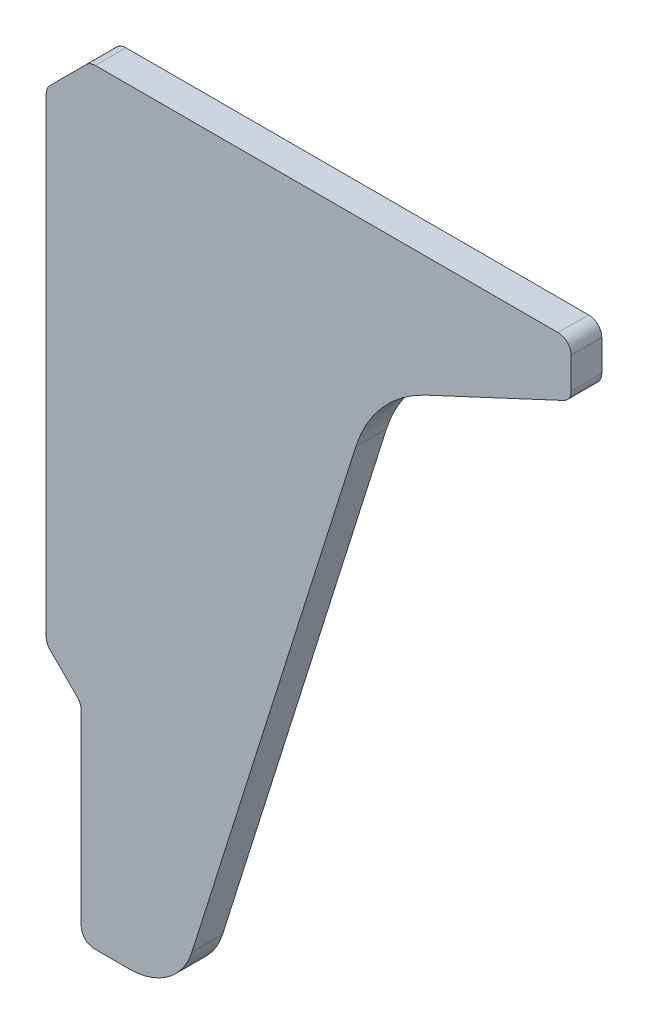
ISO-10303-21;
HEADER;
FILE_DESCRIPTION(('STEP AP214'),'2;1');
FILE_NAME('part.step','',(''),(''),'','','');
FILE_SCHEMA(('AUTOMOTIVE_DESIGN { 1 0 10303 214 1 1 1 1 }'));
ENDSEC;
DATA;
#1=APPLICATION_CONTEXT('core data for automotive mechanical design processes');
#2=APPLICATION_PROTOCOL_DEFINITION('international standard','automotive_design',2000,#1);
#3=PRODUCT_CONTEXT('',#1,'mechanical');
#4=PRODUCT('Part','Part','',(#3));
#5=PRODUCT_RELATED_PRODUCT_CATEGORY('part','',(#4));
#6=PRODUCT_DEFINITION_FORMATION('','',#4);
#7=PRODUCT_DEFINITION_CONTEXT('part definition',#1,'design');
#8=PRODUCT_DEFINITION('design','',#6,#7);
#9=PRODUCT_DEFINITION_SHAPE('','',#8);
#10=(LENGTH_UNIT() NAMED_UNIT(*) SI_UNIT(.MILLI.,.METRE.));
#11=(NAMED_UNIT(*) PLANE_ANGLE_UNIT() SI_UNIT($,.RADIAN.));
#12=(NAMED_UNIT(*) SI_UNIT($,.STERADIAN.) SOLID_ANGLE_UNIT());
#13=UNCERTAINTY_MEASURE_WITH_UNIT(LENGTH_MEASURE(1.E-05),#10,'distance_accuracy_value','');
#14=(GEOMETRIC_REPRESENTATION_CONTEXT(3) GLOBAL_UNCERTAINTY_ASSIGNED_CONTEXT((#13)) GLOBAL_UNIT_ASSIGNED_CONTEXT((#10,
#11,#12)) REPRESENTATION_CONTEXT('',''));
#15=CARTESIAN_POINT('',(0.,0.,0.));
#16=DIRECTION('',(0.,0.,1.));
#17=DIRECTION('',(1.,0.,0.));
#18=AXIS2_PLACEMENT_3D('',#15,#16,#17);
#19=CARTESIAN_POINT('',(91.3812704140145,120.283990923753,7.));
#20=DIRECTION('',(0.,0.,-1.));
#21=DIRECTION('',(-1.,0.,0.));
#22=AXIS2_PLACEMENT_3D('',#19,#20,#21);
#23=CYLINDRICAL_SURFACE('',#22,30.);
#24=CARTESIAN_POINT('',(91.3812704140145,120.283990923753,0.));
#25=DIRECTION('',(0.,0.,-1.));
#26=DIRECTION('',(1.,0.,0.));
#27=AXIS2_PLACEMENT_3D('',#24,#25,#26);
#28=CIRCLE('',#27,30.);
#29=CARTESIAN_POINT('',(62.7697618915677,129.305164908882,0.));
#30=VERTEX_POINT('',#29);
#31=CARTESIAN_POINT('',(78.7027225617937,147.473224534853,0.));
#32=VERTEX_POINT('',#31);
#33=EDGE_CURVE('E195',#30,#32,#28,.T.);
#34=ORIENTED_EDGE('',*,*,#33,.T.);
#35=DIRECTION('',(0.,0.,-1.));
#36=VECTOR('',#35,1.);
#37=CARTESIAN_POINT('',(78.7027225617937,147.473224534853,7.));
#38=LINE('',#37,#36);
#39=CARTESIAN_POINT('',(78.7027225617937,147.473224534853,7.));
#40=VERTEX_POINT('',#39);
#41=EDGE_CURVE('E11',#40,#32,#38,.T.);
#42=ORIENTED_EDGE('',*,*,#41,.F.);
#43=CARTESIAN_POINT('',(91.3812704140145,120.283990923753,7.));
#44=DIRECTION('',(0.,0.,-1.));
#45=DIRECTION('',(1.,0.,0.));
#46=AXIS2_PLACEMENT_3D('',#43,#44,#45);
#47=CIRCLE('',#46,30.);
#48=CARTESIAN_POINT('',(62.7697618915677,129.305164908882,7.));
#49=VERTEX_POINT('',#48);
#50=EDGE_CURVE('E229',#49,#40,#47,.T.);
#51=ORIENTED_EDGE('',*,*,#50,.F.);
#52=DIRECTION('',(0.,0.,-1.));
#53=VECTOR('',#52,1.);
#54=CARTESIAN_POINT('',(62.7697618915677,129.305164908882,7.));
#55=LINE('',#54,#53);
#56=EDGE_CURVE('E191',#49,#30,#55,.T.);
#57=ORIENTED_EDGE('',*,*,#56,.T.);
#58=EDGE_LOOP('',(#34,#42,#51,#57));
#59=FACE_BOUND('',#58,.T.);
#60=ADVANCED_FACE('F39',(#59),#23,.F.);
#61=CARTESIAN_POINT('',(110.267854785222,162.192287421312,7.));
#62=DIRECTION('',(-0.422618261740693,0.906307787036653,0.));
#63=DIRECTION('',(-0.906307787036653,-0.422618261740693,0.));
#64=AXIS2_PLACEMENT_3D('',#61,#62,#63);
#65=PLANE('',#64);
#66=DIRECTION('',(0.906307787036653,0.422618261740693,0.));
#67=VECTOR('',#66,1.);
#68=CARTESIAN_POINT('',(110.267854785222,162.192287421312,0.));
#69=LINE('',#68,#67);
#70=CARTESIAN_POINT('',(110.267854785222,162.192287421312,0.));
#71=VERTEX_POINT('',#70);
#72=EDGE_CURVE('E198',#32,#71,#69,.T.);
#73=ORIENTED_EDGE('',*,*,#72,.T.);
#74=DIRECTION('',(0.,0.,-1.));
#75=VECTOR('',#74,1.);
#76=CARTESIAN_POINT('',(110.267854785222,162.192287421312,7.));
#77=LINE('',#76,#75);
#78=CARTESIAN_POINT('',(110.267854785222,162.192287421312,7.));
#79=VERTEX_POINT('',#78);
#80=EDGE_CURVE('E47',#79,#71,#77,.T.);
#81=ORIENTED_EDGE('',*,*,#80,.F.);
#82=DIRECTION('',(0.906307787036653,0.422618261740693,0.));
#83=VECTOR('',#82,1.);
#84=CARTESIAN_POINT('',(110.267854785222,162.192287421312,7.));
#85=LINE('',#84,#83);
#86=EDGE_CURVE('E128',#40,#79,#85,.T.);
#87=ORIENTED_EDGE('',*,*,#86,.F.);
#88=ORIENTED_EDGE('',*,*,#41,.T.);
#89=EDGE_LOOP('',(#73,#81,#87,#88));
#90=FACE_BOUND('',#89,.T.);
#91=ADVANCED_FACE('F337',(#90),#65,.F.);
#92=CARTESIAN_POINT('',(109.,164.911210782422,7.));
#93=DIRECTION('',(0.,0.,-1.));
#94=DIRECTION('',(-1.,0.,0.));
#95=AXIS2_PLACEMENT_3D('',#92,#93,#94);
#96=CYLINDRICAL_SURFACE('',#95,3.);
#97=CARTESIAN_POINT('',(109.,164.911210782422,0.));
#98=DIRECTION('',(0.,0.,1.));
#99=DIRECTION('',(1.,0.,0.));
#100=AXIS2_PLACEMENT_3D('',#97,#98,#99);
#101=CIRCLE('',#100,3.);
#102=CARTESIAN_POINT('',(112.,164.911210782422,0.));
#103=VERTEX_POINT('',#102);
#104=EDGE_CURVE('E200',#71,#103,#101,.T.);
#105=ORIENTED_EDGE('',*,*,#104,.T.);
#106=DIRECTION('',(0.,0.,-1.));
#107=VECTOR('',#106,1.);
#108=CARTESIAN_POINT('',(112.,164.911210782422,7.));
#109=LINE('',#108,#107);
#110=CARTESIAN_POINT('',(112.,164.911210782422,7.));
#111=VERTEX_POINT('',#110);
#112=EDGE_CURVE('E266',#111,#103,#109,.T.);
#113=ORIENTED_EDGE('',*,*,#112,.F.);
#114=CARTESIAN_POINT('',(109.,164.911210782422,7.));
#115=DIRECTION('',(0.,0.,1.));
#116=DIRECTION('',(1.,0.,0.));
#117=AXIS2_PLACEMENT_3D('',#114,#115,#116);
#118=CIRCLE('',#117,3.);
#119=EDGE_CURVE('E274',#79,#111,#118,.T.);
#120=ORIENTED_EDGE('',*,*,#119,.F.);
#121=ORIENTED_EDGE('',*,*,#80,.T.);
#122=EDGE_LOOP('',(#105,#113,#120,#121));
#123=FACE_BOUND('',#122,.T.);
#124=ADVANCED_FACE('F272',(#123),#96,.T.);
#125=CARTESIAN_POINT('',(112.,172.,7.));
#126=DIRECTION('',(-1.,0.,0.));
#127=DIRECTION('',(0.,0.,1.));
#128=AXIS2_PLACEMENT_3D('',#125,#126,#127);
#129=PLANE('',#128);
#130=DIRECTION('',(0.,1.,0.));
#131=VECTOR('',#130,1.);
#132=CARTESIAN_POINT('',(112.,172.,0.));
#133=LINE('',#132,#131);
#134=CARTESIAN_POINT('',(112.,172.,0.));
#135=VERTEX_POINT('',#134);
#136=EDGE_CURVE('E202',#103,#135,#133,.T.);
#137=ORIENTED_EDGE('',*,*,#136,.T.);
#138=DIRECTION('',(0.,0.,-1.));
#139=VECTOR('',#138,1.);
#140=CARTESIAN_POINT('',(112.,172.,7.));
#141=LINE('',#140,#139);
#142=CARTESIAN_POINT('',(112.,172.,7.));
#143=VERTEX_POINT('',#142);
#144=EDGE_CURVE('E263',#143,#135,#141,.T.);
#145=ORIENTED_EDGE('',*,*,#144,.F.);
#146=DIRECTION('',(0.,1.,0.));
#147=VECTOR('',#146,1.);
#148=CARTESIAN_POINT('',(112.,172.,7.));
#149=LINE('',#148,#147);
#150=EDGE_CURVE('E292',#111,#143,#149,.T.);
#151=ORIENTED_EDGE('',*,*,#150,.F.);
#152=ORIENTED_EDGE('',*,*,#112,.T.);
#153=EDGE_LOOP('',(#137,#145,#151,#152));
#154=FACE_BOUND('',#153,.T.);
#155=ADVANCED_FACE('F283',(#154),#129,.F.);
#156=CARTESIAN_POINT('',(109.,172.,7.));
#157=DIRECTION('',(0.,0.,-1.));
#158=DIRECTION('',(-1.,0.,0.));
#159=AXIS2_PLACEMENT_3D('',#156,#157,#158);
#160=CYLINDRICAL_SURFACE('',#159,3.);
#161=CARTESIAN_POINT('',(109.,172.,0.));
#162=DIRECTION('',(0.,0.,1.));
#163=DIRECTION('',(-1.,0.,0.));
#164=AXIS2_PLACEMENT_3D('',#161,#162,#163);
#165=CIRCLE('',#164,3.);
#166=CARTESIAN_POINT('',(109.,175.,0.));
#167=VERTEX_POINT('',#166);
#168=EDGE_CURVE('E204',#135,#167,#165,.T.);
#169=ORIENTED_EDGE('',*,*,#168,.T.);
#170=DIRECTION('',(0.,0.,-1.));
#171=VECTOR('',#170,1.);
#172=CARTESIAN_POINT('',(109.,175.,7.));
#173=LINE('',#172,#171);
#174=CARTESIAN_POINT('',(109.,175.,7.));
#175=VERTEX_POINT('',#174);
#176=EDGE_CURVE('E260',#175,#167,#173,.T.);
#177=ORIENTED_EDGE('',*,*,#176,.F.);
#178=CARTESIAN_POINT('',(109.,172.,7.));
#179=DIRECTION('',(0.,0.,1.));
#180=DIRECTION('',(-1.,0.,0.));
#181=AXIS2_PLACEMENT_3D('',#178,#179,#180);
#182=CIRCLE('',#181,3.);
#183=EDGE_CURVE('E289',#143,#175,#182,.T.);
#184=ORIENTED_EDGE('',*,*,#183,.F.);
#185=ORIENTED_EDGE('',*,*,#144,.T.);
#186=EDGE_LOOP('',(#169,#177,#184,#185));
#187=FACE_BOUND('',#186,.T.);
#188=ADVANCED_FACE('F287',(#187),#160,.T.);
#189=CARTESIAN_POINT('',(3.24264068711928,175.,7.));
#190=DIRECTION('',(0.,-1.,0.));
#191=DIRECTION('',(0.,0.,-1.));
#192=AXIS2_PLACEMENT_3D('',#189,#190,#191);
#193=PLANE('',#192);
#194=DIRECTION('',(-1.,0.,0.));
#195=VECTOR('',#194,1.);
#196=CARTESIAN_POINT('',(3.24264068711928,175.,0.));
#197=LINE('',#196,#195);
#198=CARTESIAN_POINT('',(3.24264068711928,175.,0.));
#199=VERTEX_POINT('',#198);
#200=EDGE_CURVE('E206',#167,#199,#197,.T.);
#201=ORIENTED_EDGE('',*,*,#200,.T.);
#202=DIRECTION('',(0.,0.,-1.));
#203=VECTOR('',#202,1.);
#204=CARTESIAN_POINT('',(3.24264068711928,175.,7.));
#205=LINE('',#204,#203);
#206=CARTESIAN_POINT('',(3.24264068711928,175.,7.));
#207=VERTEX_POINT('',#206);
#208=EDGE_CURVE('E257',#207,#199,#205,.T.);
#209=ORIENTED_EDGE('',*,*,#208,.F.);
#210=DIRECTION('',(-1.,0.,0.));
#211=VECTOR('',#210,1.);
#212=CARTESIAN_POINT('',(3.24264068711928,175.,7.));
#213=LINE('',#212,#211);
#214=EDGE_CURVE('E291',#175,#207,#213,.T.);
#215=ORIENTED_EDGE('',*,*,#214,.F.);
#216=ORIENTED_EDGE('',*,*,#176,.T.);
#217=EDGE_LOOP('',(#201,#209,#215,#216));
#218=FACE_BOUND('',#217,.T.);
#219=ADVANCED_FACE('F350',(#218),#193,.F.);
#220=CARTESIAN_POINT('',(3.24264068711928,172.,7.));
#221=DIRECTION('',(0.,0.,-1.));
#222=DIRECTION('',(-1.,0.,0.));
#223=AXIS2_PLACEMENT_3D('',#220,#221,#222);
#224=CYLINDRICAL_SURFACE('',#223,3.);
#225=CARTESIAN_POINT('',(3.24264068711928,172.,0.));
#226=DIRECTION('',(0.,0.,1.));
#227=DIRECTION('',(-1.,0.,0.));
#228=AXIS2_PLACEMENT_3D('',#225,#226,#227);
#229=CIRCLE('',#228,3.);
#230=CARTESIAN_POINT('',(1.12132034355963,174.12132034356,0.));
#231=VERTEX_POINT('',#230);
#232=EDGE_CURVE('E208',#199,#231,#229,.T.);
#233=ORIENTED_EDGE('',*,*,#232,.T.);
#234=DIRECTION('',(0.,0.,-1.));
#235=VECTOR('',#234,1.);
#236=CARTESIAN_POINT('',(1.12132034355963,174.12132034356,7.));
#237=LINE('',#236,#235);
#238=CARTESIAN_POINT('',(1.12132034355963,174.12132034356,7.));
#239=VERTEX_POINT('',#238);
#240=EDGE_CURVE('E254',#239,#231,#237,.T.);
#241=ORIENTED_EDGE('',*,*,#240,.F.);
#242=CARTESIAN_POINT('',(3.24264068711928,172.,7.));
#243=DIRECTION('',(0.,0.,1.));
#244=DIRECTION('',(-1.,0.,0.));
#245=AXIS2_PLACEMENT_3D('',#242,#243,#244);
#246=CIRCLE('',#245,3.);
#247=EDGE_CURVE('E294',#207,#239,#246,.T.);
#248=ORIENTED_EDGE('',*,*,#247,.F.);
#249=ORIENTED_EDGE('',*,*,#208,.T.);
#250=EDGE_LOOP('',(#233,#241,#248,#249));
#251=FACE_BOUND('',#250,.T.);
#252=ADVANCED_FACE('F353',(#251),#224,.T.);
#253=CARTESIAN_POINT('',(-7.12132034355964,165.87867965644,7.));
#254=DIRECTION('',(0.707106781186547,-0.707106781186548,0.));
#255=DIRECTION('',(0.707106781186548,0.707106781186547,0.));
#256=AXIS2_PLACEMENT_3D('',#253,#254,#255);
#257=PLANE('',#256);
#258=DIRECTION('',(-0.707106781186548,-0.707106781186547,0.));
#259=VECTOR('',#258,1.);
#260=CARTESIAN_POINT('',(-7.12132034355964,165.87867965644,0.));
#261=LINE('',#260,#259);
#262=CARTESIAN_POINT('',(-7.12132034355964,165.87867965644,0.));
#263=VERTEX_POINT('',#262);
#264=EDGE_CURVE('E210',#231,#263,#261,.T.);
#265=ORIENTED_EDGE('',*,*,#264,.T.);
#266=DIRECTION('',(0.,0.,-1.));
#267=VECTOR('',#266,1.);
#268=CARTESIAN_POINT('',(-7.12132034355964,165.87867965644,7.));
#269=LINE('',#268,#267);
#270=CARTESIAN_POINT('',(-7.12132034355964,165.87867965644,7.));
#271=VERTEX_POINT('',#270);
#272=EDGE_CURVE('E251',#271,#263,#269,.T.);
#273=ORIENTED_EDGE('',*,*,#272,.F.);
#274=DIRECTION('',(-0.707106781186548,-0.707106781186547,0.));
#275=VECTOR('',#274,1.);
#276=CARTESIAN_POINT('',(-7.12132034355964,165.87867965644,7.));
#277=LINE('',#276,#275);
#278=EDGE_CURVE('E300',#239,#271,#277,.T.);
#279=ORIENTED_EDGE('',*,*,#278,.F.);
#280=ORIENTED_EDGE('',*,*,#240,.T.);
#281=EDGE_LOOP('',(#265,#273,#279,#280));
#282=FACE_BOUND('',#281,.T.);
#283=ADVANCED_FACE('F357',(#282),#257,.F.);
#284=CARTESIAN_POINT('',(-5.,163.757359312881,7.));
#285=DIRECTION('',(0.,0.,-1.));
#286=DIRECTION('',(-1.,0.,0.));
#287=AXIS2_PLACEMENT_3D('',#284,#285,#286);
#288=CYLINDRICAL_SURFACE('',#287,3.);
#289=CARTESIAN_POINT('',(-5.,163.757359312881,0.));
#290=DIRECTION('',(0.,0.,1.));
#291=DIRECTION('',(1.,0.,0.));
#292=AXIS2_PLACEMENT_3D('',#289,#290,#291);
#293=CIRCLE('',#292,3.);
#294=CARTESIAN_POINT('',(-8.,163.757359312881,0.));
#295=VERTEX_POINT('',#294);
#296=EDGE_CURVE('E212',#263,#295,#293,.T.);
#297=ORIENTED_EDGE('',*,*,#296,.T.);
#298=DIRECTION('',(0.,0.,-1.));
#299=VECTOR('',#298,1.);
#300=CARTESIAN_POINT('',(-8.,163.757359312881,7.));
#301=LINE('',#300,#299);
#302=CARTESIAN_POINT('',(-8.,163.757359312881,7.));
#303=VERTEX_POINT('',#302);
#304=EDGE_CURVE('E248',#303,#295,#301,.T.);
#305=ORIENTED_EDGE('',*,*,#304,.F.);
#306=CARTESIAN_POINT('',(-5.,163.757359312881,7.));
#307=DIRECTION('',(0.,0.,1.));
#308=DIRECTION('',(1.,0.,0.));
#309=AXIS2_PLACEMENT_3D('',#306,#307,#308);
#310=CIRCLE('',#309,3.);
#311=EDGE_CURVE('E302',#271,#303,#310,.T.);
#312=ORIENTED_EDGE('',*,*,#311,.F.);
#313=ORIENTED_EDGE('',*,*,#272,.T.);
#314=EDGE_LOOP('',(#297,#305,#312,#313));
#315=FACE_BOUND('',#314,.T.);
#316=ADVANCED_FACE('F361',(#315),#288,.T.);
#317=CARTESIAN_POINT('',(-8.,56.2426406871193,7.));
#318=DIRECTION('',(1.,0.,0.));
#319=DIRECTION('',(0.,1.,0.));
#320=AXIS2_PLACEMENT_3D('',#317,#318,#319);
#321=PLANE('',#320);
#322=DIRECTION('',(0.,-1.,0.));
#323=VECTOR('',#322,1.);
#324=CARTESIAN_POINT('',(-8.,56.2426406871193,0.));
#325=LINE('',#324,#323);
#326=CARTESIAN_POINT('',(-8.,56.2426406871193,0.));
#327=VERTEX_POINT('',#326);
#328=EDGE_CURVE('E214',#295,#327,#325,.T.);
#329=ORIENTED_EDGE('',*,*,#328,.T.);
#330=DIRECTION('',(0.,0.,-1.));
#331=VECTOR('',#330,1.);
#332=CARTESIAN_POINT('',(-8.,56.2426406871193,7.));
#333=LINE('',#332,#331);
#334=CARTESIAN_POINT('',(-8.,56.2426406871193,7.));
#335=VERTEX_POINT('',#334);
#336=EDGE_CURVE('E245',#335,#327,#333,.T.);
#337=ORIENTED_EDGE('',*,*,#336,.F.);
#338=DIRECTION('',(0.,-1.,0.));
#339=VECTOR('',#338,1.);
#340=CARTESIAN_POINT('',(-8.,56.2426406871193,7.));
#341=LINE('',#340,#339);
#342=EDGE_CURVE('E304',#303,#335,#341,.T.);
#343=ORIENTED_EDGE('',*,*,#342,.F.);
#344=ORIENTED_EDGE('',*,*,#304,.T.);
#345=EDGE_LOOP('',(#329,#337,#343,#344));
#346=FACE_BOUND('',#345,.T.);
#347=ADVANCED_FACE('F365',(#346),#321,.F.);
#348=CARTESIAN_POINT('',(-5.,56.2426406871193,7.));
#349=DIRECTION('',(0.,0.,-1.));
#350=DIRECTION('',(-1.,0.,0.));
#351=AXIS2_PLACEMENT_3D('',#348,#349,#350);
#352=CYLINDRICAL_SURFACE('',#351,3.);
#353=CARTESIAN_POINT('',(-5.,56.2426406871193,0.));
#354=DIRECTION('',(0.,0.,1.));
#355=DIRECTION('',(-1.,0.,0.));
#356=AXIS2_PLACEMENT_3D('',#353,#354,#355);
#357=CIRCLE('',#356,3.);
#358=CARTESIAN_POINT('',(-7.12132034355964,54.1213203435597,0.));
#359=VERTEX_POINT('',#358);
#360=EDGE_CURVE('E216',#327,#359,#357,.T.);
#361=ORIENTED_EDGE('',*,*,#360,.T.);
#362=DIRECTION('',(0.,0.,-1.));
#363=VECTOR('',#362,1.);
#364=CARTESIAN_POINT('',(-7.12132034355964,54.1213203435597,7.));
#365=LINE('',#364,#363);
#366=CARTESIAN_POINT('',(-7.12132034355964,54.1213203435597,7.));
#367=VERTEX_POINT('',#366);
#368=EDGE_CURVE('E242',#367,#359,#365,.T.);
#369=ORIENTED_EDGE('',*,*,#368,.F.);
#370=CARTESIAN_POINT('',(-5.,56.2426406871193,7.));
#371=DIRECTION('',(0.,0.,1.));
#372=DIRECTION('',(-1.,0.,0.));
#373=AXIS2_PLACEMENT_3D('',#370,#371,#372);
#374=CIRCLE('',#373,3.);
#375=EDGE_CURVE('E306',#335,#367,#374,.T.);
#376=ORIENTED_EDGE('',*,*,#375,.F.);
#377=ORIENTED_EDGE('',*,*,#336,.T.);
#378=EDGE_LOOP('',(#361,#369,#376,#377));
#379=FACE_BOUND('',#378,.T.);
#380=ADVANCED_FACE('F369',(#379),#352,.T.);
#381=CARTESIAN_POINT('',(-7.12132034355964,54.1213203435597,7.));
#382=DIRECTION('',(0.707106781186547,0.707106781186547,0.));
#383=DIRECTION('',(-0.707106781186548,0.707106781186548,0.));
#384=AXIS2_PLACEMENT_3D('',#381,#382,#383);
#385=PLANE('',#384);
#386=DIRECTION('',(0.707106781186548,-0.707106781186548,0.));
#387=VECTOR('',#386,1.);
#388=CARTESIAN_POINT('',(-7.12132034355964,54.1213203435597,0.));
#389=LINE('',#388,#387);
#390=CARTESIAN_POINT('',(-0.878679656440354,47.8786796564404,0.));
#391=VERTEX_POINT('',#390);
#392=EDGE_CURVE('E218',#359,#391,#389,.T.);
#393=ORIENTED_EDGE('',*,*,#392,.T.);
#394=DIRECTION('',(0.,0.,-1.));
#395=VECTOR('',#394,1.);
#396=CARTESIAN_POINT('',(-0.878679656440354,47.8786796564404,7.));
#397=LINE('',#396,#395);
#398=CARTESIAN_POINT('',(-0.878679656440354,47.8786796564404,7.));
#399=VERTEX_POINT('',#398);
#400=EDGE_CURVE('E239',#399,#391,#397,.T.);
#401=ORIENTED_EDGE('',*,*,#400,.F.);
#402=DIRECTION('',(0.707106781186548,-0.707106781186548,0.));
#403=VECTOR('',#402,1.);
#404=CARTESIAN_POINT('',(-7.12132034355964,54.1213203435597,7.));
#405=LINE('',#404,#403);
#406=EDGE_CURVE('E308',#367,#399,#405,.T.);
#407=ORIENTED_EDGE('',*,*,#406,.F.);
#408=ORIENTED_EDGE('',*,*,#368,.T.);
#409=EDGE_LOOP('',(#393,#401,#407,#408));
#410=FACE_BOUND('',#409,.T.);
#411=ADVANCED_FACE('F373',(#410),#385,.F.);
#412=CARTESIAN_POINT('',(-3.,45.7573593128807,7.));
#413=DIRECTION('',(0.,0.,-1.));
#414=DIRECTION('',(-1.,0.,0.));
#415=AXIS2_PLACEMENT_3D('',#412,#413,#414);
#416=CYLINDRICAL_SURFACE('',#415,3.);
#417=CARTESIAN_POINT('',(-3.,45.7573593128807,0.));
#418=DIRECTION('',(0.,0.,-1.));
#419=DIRECTION('',(-1.,0.,0.));
#420=AXIS2_PLACEMENT_3D('',#417,#418,#419);
#421=CIRCLE('',#420,3.);
#422=CARTESIAN_POINT('',(0.,45.7573593128807,0.));
#423=VERTEX_POINT('',#422);
#424=EDGE_CURVE('E220',#391,#423,#421,.T.);
#425=ORIENTED_EDGE('',*,*,#424,.T.);
#426=DIRECTION('',(0.,0.,-1.));
#427=VECTOR('',#426,1.);
#428=CARTESIAN_POINT('',(0.,45.7573593128807,7.));
#429=LINE('',#428,#427);
#430=CARTESIAN_POINT('',(0.,45.7573593128807,7.));
#431=VERTEX_POINT('',#430);
#432=EDGE_CURVE('E236',#431,#423,#429,.T.);
#433=ORIENTED_EDGE('',*,*,#432,.F.);
#434=CARTESIAN_POINT('',(-3.,45.7573593128807,7.));
#435=DIRECTION('',(0.,0.,-1.));
#436=DIRECTION('',(-1.,0.,0.));
#437=AXIS2_PLACEMENT_3D('',#434,#435,#436);
#438=CIRCLE('',#437,3.);
#439=EDGE_CURVE('E310',#399,#431,#438,.T.);
#440=ORIENTED_EDGE('',*,*,#439,.F.);
#441=ORIENTED_EDGE('',*,*,#400,.T.);
#442=EDGE_LOOP('',(#425,#433,#440,#441));
#443=FACE_BOUND('',#442,.T.);
#444=ADVANCED_FACE('F377',(#443),#416,.F.);
#445=CARTESIAN_POINT('',(0.,3.00000000000002,7.));
#446=DIRECTION('',(1.,0.,0.));
#447=DIRECTION('',(0.,1.,0.));
#448=AXIS2_PLACEMENT_3D('',#445,#446,#447);
#449=PLANE('',#448);
#450=DIRECTION('',(0.,-1.,0.));
#451=VECTOR('',#450,1.);
#452=CARTESIAN_POINT('',(0.,3.00000000000002,0.));
#453=LINE('',#452,#451);
#454=CARTESIAN_POINT('',(0.,3.00000000000002,0.));
#455=VERTEX_POINT('',#454);
#456=EDGE_CURVE('E222',#423,#455,#453,.T.);
#457=ORIENTED_EDGE('',*,*,#456,.T.);
#458=DIRECTION('',(0.,0.,-1.));
#459=VECTOR('',#458,1.);
#460=CARTESIAN_POINT('',(0.,3.00000000000002,7.));
#461=LINE('',#460,#459);
#462=CARTESIAN_POINT('',(0.,3.00000000000002,7.));
#463=VERTEX_POINT('',#462);
#464=EDGE_CURVE('E233',#463,#455,#461,.T.);
#465=ORIENTED_EDGE('',*,*,#464,.F.);
#466=DIRECTION('',(0.,-1.,0.));
#467=VECTOR('',#466,1.);
#468=CARTESIAN_POINT('',(0.,3.00000000000002,7.));
#469=LINE('',#468,#467);
#470=EDGE_CURVE('E312',#431,#463,#469,.T.);
#471=ORIENTED_EDGE('',*,*,#470,.F.);
#472=ORIENTED_EDGE('',*,*,#432,.T.);
#473=EDGE_LOOP('',(#457,#465,#471,#472));
#474=FACE_BOUND('',#473,.T.);
#475=ADVANCED_FACE('F318',(#474),#449,.F.);
#476=CARTESIAN_POINT('',(3.,3.,7.));
#477=DIRECTION('',(0.,0.,-1.));
#478=DIRECTION('',(-1.,0.,0.));
#479=AXIS2_PLACEMENT_3D('',#476,#477,#478);
#480=CYLINDRICAL_SURFACE('',#479,3.);
#481=CARTESIAN_POINT('',(3.,3.,0.));
#482=DIRECTION('',(0.,0.,1.));
#483=DIRECTION('',(1.,0.,0.));
#484=AXIS2_PLACEMENT_3D('',#481,#482,#483);
#485=CIRCLE('',#484,3.);
#486=CARTESIAN_POINT('',(3.00000000000002,0.,0.));
#487=VERTEX_POINT('',#486);
#488=EDGE_CURVE('E224',#455,#487,#485,.T.);
#489=ORIENTED_EDGE('',*,*,#488,.T.);
#490=DIRECTION('',(0.,0.,-1.));
#491=VECTOR('',#490,1.);
#492=CARTESIAN_POINT('',(3.00000000000002,0.,7.));
#493=LINE('',#492,#491);
#494=CARTESIAN_POINT('',(3.00000000000002,0.,7.));
#495=VERTEX_POINT('',#494);
#496=EDGE_CURVE('E186',#495,#487,#493,.T.);
#497=ORIENTED_EDGE('',*,*,#496,.F.);
#498=CARTESIAN_POINT('',(3.,3.,7.));
#499=DIRECTION('',(0.,0.,1.));
#500=DIRECTION('',(1.,0.,0.));
#501=AXIS2_PLACEMENT_3D('',#498,#499,#500);
#502=CIRCLE('',#501,3.);
#503=EDGE_CURVE('E177',#463,#495,#502,.T.);
#504=ORIENTED_EDGE('',*,*,#503,.F.);
#505=ORIENTED_EDGE('',*,*,#464,.T.);
#506=EDGE_LOOP('',(#489,#497,#504,#505));
#507=FACE_BOUND('',#506,.T.);
#508=ADVANCED_FACE('F322',(#507),#480,.T.);
#509=CARTESIAN_POINT('',(11.0015449560726,0.,7.));
#510=DIRECTION('',(0.,1.,0.));
#511=DIRECTION('',(0.,0.,1.));
#512=AXIS2_PLACEMENT_3D('',#509,#510,#511);
#513=PLANE('',#512);
#514=DIRECTION('',(1.,0.,0.));
#515=VECTOR('',#514,1.);
#516=CARTESIAN_POINT('',(11.0015449560726,0.,0.));
#517=LINE('',#516,#515);
#518=CARTESIAN_POINT('',(11.0015449560726,0.,0.));
#519=VERTEX_POINT('',#518);
#520=EDGE_CURVE('E185',#487,#519,#517,.T.);
#521=ORIENTED_EDGE('',*,*,#520,.T.);
#522=DIRECTION('',(0.,0.,-1.));
#523=VECTOR('',#522,1.);
#524=CARTESIAN_POINT('',(11.0015449560726,0.,7.));
#525=LINE('',#524,#523);
#526=CARTESIAN_POINT('',(11.0015449560726,0.,7.));
#527=VERTEX_POINT('',#526);
#528=EDGE_CURVE('E182',#527,#519,#525,.T.);
#529=ORIENTED_EDGE('',*,*,#528,.F.);
#530=DIRECTION('',(1.,0.,0.));
#531=VECTOR('',#530,1.);
#532=CARTESIAN_POINT('',(11.0015449560726,0.,7.));
#533=LINE('',#532,#531);
#534=EDGE_CURVE('E171',#495,#527,#533,.T.);
#535=ORIENTED_EDGE('',*,*,#534,.F.);
#536=ORIENTED_EDGE('',*,*,#496,.T.);
#537=EDGE_LOOP('',(#521,#529,#535,#536));
#538=FACE_BOUND('',#537,.T.);
#539=ADVANCED_FACE('F183',(#538),#513,.F.);
#540=CARTESIAN_POINT('',(11.0015449560726,15.,7.));
#541=DIRECTION('',(0.,0.,-1.));
#542=DIRECTION('',(-1.,0.,0.));
#543=AXIS2_PLACEMENT_3D('',#540,#541,#542);
#544=CYLINDRICAL_SURFACE('',#543,15.);
#545=CARTESIAN_POINT('',(11.0015449560726,15.,0.));
#546=DIRECTION('',(0.,0.,1.));
#547=DIRECTION('',(1.,0.,0.));
#548=AXIS2_PLACEMENT_3D('',#545,#546,#547);
#549=CIRCLE('',#548,15.);
#550=CARTESIAN_POINT('',(25.307299217296,10.4894130074359,0.));
#551=VERTEX_POINT('',#550);
#552=EDGE_CURVE('E114',#519,#551,#549,.T.);
#553=ORIENTED_EDGE('',*,*,#552,.T.);
#554=DIRECTION('',(0.,0.,-1.));
#555=VECTOR('',#554,1.);
#556=CARTESIAN_POINT('',(25.307299217296,10.4894130074359,7.));
#557=LINE('',#556,#555);
#558=CARTESIAN_POINT('',(25.307299217296,10.4894130074359,7.));
#559=VERTEX_POINT('',#558);
#560=EDGE_CURVE('E187',#559,#551,#557,.T.);
#561=ORIENTED_EDGE('',*,*,#560,.F.);
#562=CARTESIAN_POINT('',(11.0015449560726,15.,7.));
#563=DIRECTION('',(0.,0.,1.));
#564=DIRECTION('',(1.,0.,0.));
#565=AXIS2_PLACEMENT_3D('',#562,#563,#564);
#566=CIRCLE('',#565,15.);
#567=EDGE_CURVE('E175',#527,#559,#566,.T.);
#568=ORIENTED_EDGE('',*,*,#567,.F.);
#569=ORIENTED_EDGE('',*,*,#528,.T.);
#570=EDGE_LOOP('',(#553,#561,#568,#569));
#571=FACE_BOUND('',#570,.T.);
#572=ADVANCED_FACE('F189',(#571),#544,.T.);
#573=CARTESIAN_POINT('',(25.307299217296,10.4894130074359,7.));
#574=DIRECTION('',(-0.953716950748227,0.300705799504274,0.));
#575=DIRECTION('',(-0.300705799504274,-0.953716950748227,0.));
#576=AXIS2_PLACEMENT_3D('',#573,#574,#575);
#577=PLANE('',#576);
#578=DIRECTION('',(0.300705799504274,0.953716950748227,0.));
#579=VECTOR('',#578,1.);
#580=CARTESIAN_POINT('',(25.307299217296,10.4894130074359,0.));
#581=LINE('',#580,#579);
#582=EDGE_CURVE('E120',#551,#30,#581,.T.);
#583=ORIENTED_EDGE('',*,*,#582,.T.);
#584=ORIENTED_EDGE('',*,*,#56,.F.);
#585=DIRECTION('',(0.300705799504274,0.953716950748227,0.));
#586=VECTOR('',#585,1.);
#587=CARTESIAN_POINT('',(25.307299217296,10.4894130074359,7.));
#588=LINE('',#587,#586);
#589=EDGE_CURVE('E55',#559,#49,#588,.T.);
#590=ORIENTED_EDGE('',*,*,#589,.F.);
#591=ORIENTED_EDGE('',*,*,#560,.T.);
#592=EDGE_LOOP('',(#583,#584,#590,#591));
#593=FACE_BOUND('',#592,.T.);
#594=ADVANCED_FACE('F326',(#593),#577,.F.);
#595=CARTESIAN_POINT('',(91.3812704140145,120.283990923753,7.));
#596=DIRECTION('',(0.,0.,1.));
#597=DIRECTION('',(1.,0.,0.));
#598=AXIS2_PLACEMENT_3D('',#595,#596,#597);
#599=PLANE('',#598);
#600=ORIENTED_EDGE('',*,*,#50,.T.);
#601=ORIENTED_EDGE('',*,*,#86,.T.);
#602=ORIENTED_EDGE('',*,*,#119,.T.);
#603=ORIENTED_EDGE('',*,*,#150,.T.);
#604=ORIENTED_EDGE('',*,*,#183,.T.);
#605=ORIENTED_EDGE('',*,*,#214,.T.);
#606=ORIENTED_EDGE('',*,*,#247,.T.);
#607=ORIENTED_EDGE('',*,*,#278,.T.);
#608=ORIENTED_EDGE('',*,*,#311,.T.);
#609=ORIENTED_EDGE('',*,*,#342,.T.);
#610=ORIENTED_EDGE('',*,*,#375,.T.);
#611=ORIENTED_EDGE('',*,*,#406,.T.);
#612=ORIENTED_EDGE('',*,*,#439,.T.);
#613=ORIENTED_EDGE('',*,*,#470,.T.);
#614=ORIENTED_EDGE('',*,*,#503,.T.);
#615=ORIENTED_EDGE('',*,*,#534,.T.);
#616=ORIENTED_EDGE('',*,*,#567,.T.);
#617=ORIENTED_EDGE('',*,*,#589,.T.);
#618=EDGE_LOOP('',(#600,#601,#602,#603,#604,#605,#606,#607,#608,#609,#610,#611,#612,#613,#614,
#615,#616,#617));
#619=FACE_BOUND('',#618,.T.);
#620=ADVANCED_FACE('F173',(#619),#599,.T.);
#621=CARTESIAN_POINT('',(91.3812704140145,120.283990923753,0.));
#622=DIRECTION('',(0.,0.,1.));
#623=DIRECTION('',(1.,0.,0.));
#624=AXIS2_PLACEMENT_3D('',#621,#622,#623);
#625=PLANE('',#624);
#626=ORIENTED_EDGE('',*,*,#33,.F.);
#627=ORIENTED_EDGE('',*,*,#582,.F.);
#628=ORIENTED_EDGE('',*,*,#552,.F.);
#629=ORIENTED_EDGE('',*,*,#520,.F.);
#630=ORIENTED_EDGE('',*,*,#488,.F.);
#631=ORIENTED_EDGE('',*,*,#456,.F.);
#632=ORIENTED_EDGE('',*,*,#424,.F.);
#633=ORIENTED_EDGE('',*,*,#392,.F.);
#634=ORIENTED_EDGE('',*,*,#360,.F.);
#635=ORIENTED_EDGE('',*,*,#328,.F.);
#636=ORIENTED_EDGE('',*,*,#296,.F.);
#637=ORIENTED_EDGE('',*,*,#264,.F.);
#638=ORIENTED_EDGE('',*,*,#232,.F.);
#639=ORIENTED_EDGE('',*,*,#200,.F.);
#640=ORIENTED_EDGE('',*,*,#168,.F.);
#641=ORIENTED_EDGE('',*,*,#136,.F.);
#642=ORIENTED_EDGE('',*,*,#104,.F.);
#643=ORIENTED_EDGE('',*,*,#72,.F.);
#644=EDGE_LOOP('',(#626,#627,#628,#629,#630,#631,#632,#633,#634,#635,#636,#637,#638,#639,#640,
#641,#642,#643));
#645=FACE_BOUND('',#644,.T.);
#646=ADVANCED_FACE('F278',(#645),#625,.F.);
#647=CLOSED_SHELL('',(#60,#91,#124,#155,#188,#219,#252,#283,#316,#347,#380,#411,#444,#475,#508,
#539,#572,#594,#620,#646));
#648=MANIFOLD_SOLID_BREP('B2',#647);
#649=ADVANCED_BREP_SHAPE_REPRESENTATION('',(#18,#648),#14);
#650=SHAPE_DEFINITION_REPRESENTATION(#9,#649);
ENDSEC;
END-ISO-10303-21;
